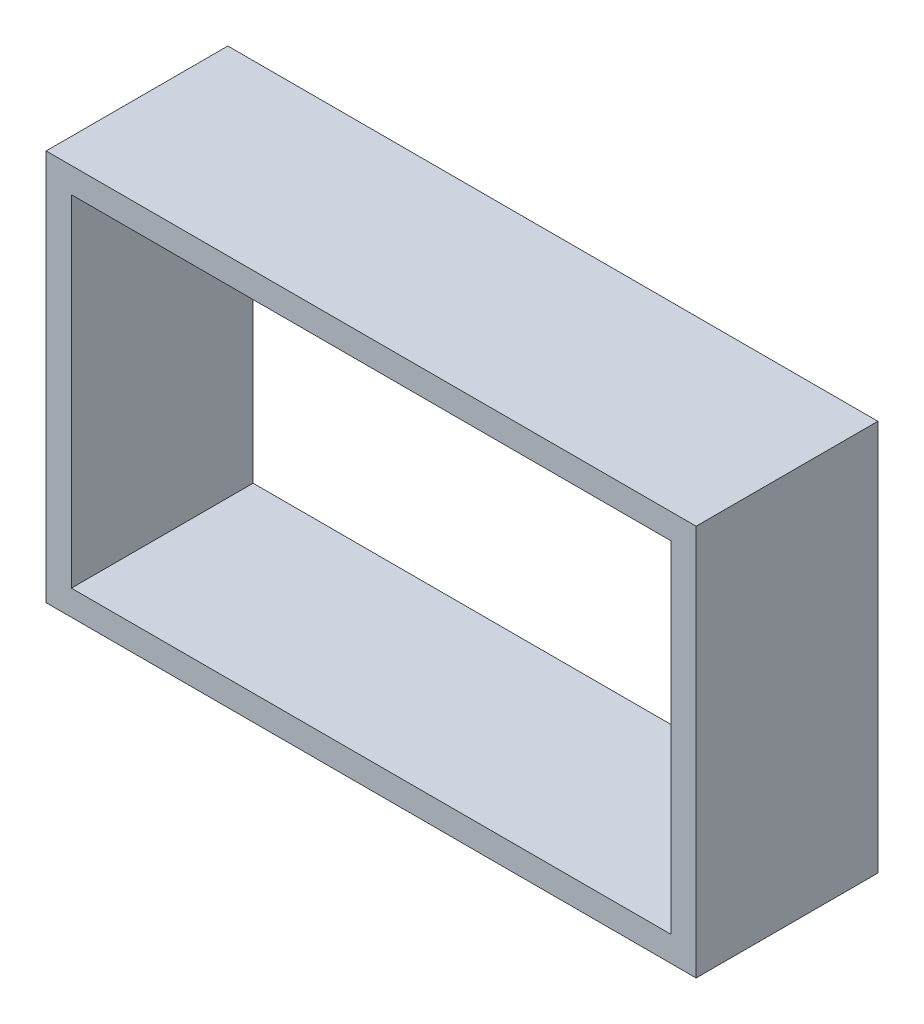
ISO-10303-21;
HEADER;
FILE_DESCRIPTION(('STEP AP214'),'2;1');
FILE_NAME('part.step','',(''),(''),'','','');
FILE_SCHEMA(('AUTOMOTIVE_DESIGN { 1 0 10303 214 1 1 1 1 }'));
ENDSEC;
DATA;
#1=APPLICATION_CONTEXT('core data for automotive mechanical design processes');
#2=APPLICATION_PROTOCOL_DEFINITION('international standard','automotive_design',2000,#1);
#3=PRODUCT_CONTEXT('',#1,'mechanical');
#4=PRODUCT('Part','Part','',(#3));
#5=PRODUCT_RELATED_PRODUCT_CATEGORY('part','',(#4));
#6=PRODUCT_DEFINITION_FORMATION('','',#4);
#7=PRODUCT_DEFINITION_CONTEXT('part definition',#1,'design');
#8=PRODUCT_DEFINITION('design','',#6,#7);
#9=PRODUCT_DEFINITION_SHAPE('','',#8);
#10=(LENGTH_UNIT() NAMED_UNIT(*) SI_UNIT(.MILLI.,.METRE.));
#11=(NAMED_UNIT(*) PLANE_ANGLE_UNIT() SI_UNIT($,.RADIAN.));
#12=(NAMED_UNIT(*) SI_UNIT($,.STERADIAN.) SOLID_ANGLE_UNIT());
#13=UNCERTAINTY_MEASURE_WITH_UNIT(LENGTH_MEASURE(1.E-05),#10,'distance_accuracy_value','');
#14=(GEOMETRIC_REPRESENTATION_CONTEXT(3) GLOBAL_UNCERTAINTY_ASSIGNED_CONTEXT((#13)) GLOBAL_UNIT_ASSIGNED_CONTEXT((#10,
#11,#12)) REPRESENTATION_CONTEXT('',''));
#15=CARTESIAN_POINT('',(0.,0.,0.));
#16=DIRECTION('',(0.,0.,1.));
#17=DIRECTION('',(1.,0.,0.));
#18=AXIS2_PLACEMENT_3D('',#15,#16,#17);
#19=CARTESIAN_POINT('',(0.,0.,14.4));
#20=DIRECTION('',(0.,0.,1.));
#21=DIRECTION('',(1.,0.,0.));
#22=AXIS2_PLACEMENT_3D('',#19,#20,#21);
#23=PLANE('',#22);
#24=DIRECTION('',(0.,-1.,0.));
#25=VECTOR('',#24,1.);
#26=CARTESIAN_POINT('',(-73.7343836950473,20.015625,14.4));
#27=LINE('',#26,#25);
#28=CARTESIAN_POINT('',(-73.7343836950473,20.015625,14.4));
#29=VERTEX_POINT('',#28);
#30=CARTESIAN_POINT('',(-73.7343836950473,-10.984375,14.4));
#31=VERTEX_POINT('',#30);
#32=EDGE_CURVE('E134',#29,#31,#27,.T.);
#33=ORIENTED_EDGE('',*,*,#32,.T.);
#34=DIRECTION('',(1.,0.,0.));
#35=VECTOR('',#34,1.);
#36=CARTESIAN_POINT('',(-73.7343836950473,-10.984375,14.4));
#37=LINE('',#36,#35);
#38=CARTESIAN_POINT('',(-22.2343836950473,-10.984375,14.4));
#39=VERTEX_POINT('',#38);
#40=EDGE_CURVE('E137',#31,#39,#37,.T.);
#41=ORIENTED_EDGE('',*,*,#40,.T.);
#42=DIRECTION('',(0.,1.,0.));
#43=VECTOR('',#42,1.);
#44=CARTESIAN_POINT('',(-22.2343836950473,20.015625,14.4));
#45=LINE('',#44,#43);
#46=CARTESIAN_POINT('',(-22.2343836950473,20.015625,14.4));
#47=VERTEX_POINT('',#46);
#48=EDGE_CURVE('E140',#39,#47,#45,.T.);
#49=ORIENTED_EDGE('',*,*,#48,.T.);
#50=DIRECTION('',(-1.,0.,0.));
#51=VECTOR('',#50,1.);
#52=CARTESIAN_POINT('',(-73.7343836950473,20.015625,14.4));
#53=LINE('',#52,#51);
#54=EDGE_CURVE('E142',#47,#29,#53,.T.);
#55=ORIENTED_EDGE('',*,*,#54,.T.);
#56=EDGE_LOOP('',(#33,#41,#49,#55));
#57=FACE_BOUND('',#56,.T.);
#58=DIRECTION('',(1.,0.,0.));
#59=VECTOR('',#58,1.);
#60=CARTESIAN_POINT('',(-71.7343836950473,-8.98437500000001,14.4));
#61=LINE('',#60,#59);
#62=CARTESIAN_POINT('',(-71.7343836950473,-8.98437500000001,14.4));
#63=VERTEX_POINT('',#62);
#64=CARTESIAN_POINT('',(-24.2343836950473,-8.98437500000001,14.4));
#65=VERTEX_POINT('',#64);
#66=EDGE_CURVE('E106',#63,#65,#61,.T.);
#67=ORIENTED_EDGE('',*,*,#66,.F.);
#68=DIRECTION('',(0.,-1.,0.));
#69=VECTOR('',#68,1.);
#70=CARTESIAN_POINT('',(-71.7343836950473,18.015625,14.4));
#71=LINE('',#70,#69);
#72=CARTESIAN_POINT('',(-71.7343836950473,18.015625,14.4));
#73=VERTEX_POINT('',#72);
#74=EDGE_CURVE('E98',#73,#63,#71,.T.);
#75=ORIENTED_EDGE('',*,*,#74,.F.);
#76=DIRECTION('',(-1.,0.,0.));
#77=VECTOR('',#76,1.);
#78=CARTESIAN_POINT('',(-71.7343836950473,18.015625,14.4));
#79=LINE('',#78,#77);
#80=CARTESIAN_POINT('',(-24.2343836950473,18.015625,14.4));
#81=VERTEX_POINT('',#80);
#82=EDGE_CURVE('E120',#81,#73,#79,.T.);
#83=ORIENTED_EDGE('',*,*,#82,.F.);
#84=DIRECTION('',(0.,1.,0.));
#85=VECTOR('',#84,1.);
#86=CARTESIAN_POINT('',(-24.2343836950473,18.015625,14.4));
#87=LINE('',#86,#85);
#88=EDGE_CURVE('E118',#65,#81,#87,.T.);
#89=ORIENTED_EDGE('',*,*,#88,.F.);
#90=EDGE_LOOP('',(#67,#75,#83,#89));
#91=FACE_BOUND('',#90,.T.);
#92=ADVANCED_FACE('F33',(#57,#91),#23,.T.);
#93=CARTESIAN_POINT('',(0.,0.,0.));
#94=DIRECTION('',(0.,0.,1.));
#95=DIRECTION('',(1.,0.,0.));
#96=AXIS2_PLACEMENT_3D('',#93,#94,#95);
#97=PLANE('',#96);
#98=DIRECTION('',(0.,-1.,0.));
#99=VECTOR('',#98,1.);
#100=CARTESIAN_POINT('',(-73.7343836950473,20.015625,0.));
#101=LINE('',#100,#99);
#102=CARTESIAN_POINT('',(-73.7343836950473,20.015625,0.));
#103=VERTEX_POINT('',#102);
#104=CARTESIAN_POINT('',(-73.7343836950473,-10.984375,0.));
#105=VERTEX_POINT('',#104);
#106=EDGE_CURVE('E114',#103,#105,#101,.T.);
#107=ORIENTED_EDGE('',*,*,#106,.F.);
#108=DIRECTION('',(-1.,0.,0.));
#109=VECTOR('',#108,1.);
#110=CARTESIAN_POINT('',(-73.7343836950473,20.015625,0.));
#111=LINE('',#110,#109);
#112=CARTESIAN_POINT('',(-22.2343836950473,20.015625,0.));
#113=VERTEX_POINT('',#112);
#114=EDGE_CURVE('E138',#113,#103,#111,.T.);
#115=ORIENTED_EDGE('',*,*,#114,.F.);
#116=DIRECTION('',(0.,1.,0.));
#117=VECTOR('',#116,1.);
#118=CARTESIAN_POINT('',(-22.2343836950473,20.015625,0.));
#119=LINE('',#118,#117);
#120=CARTESIAN_POINT('',(-22.2343836950473,-10.984375,0.));
#121=VERTEX_POINT('',#120);
#122=EDGE_CURVE('E149',#121,#113,#119,.T.);
#123=ORIENTED_EDGE('',*,*,#122,.F.);
#124=DIRECTION('',(1.,0.,0.));
#125=VECTOR('',#124,1.);
#126=CARTESIAN_POINT('',(-73.7343836950473,-10.984375,0.));
#127=LINE('',#126,#125);
#128=EDGE_CURVE('E147',#105,#121,#127,.T.);
#129=ORIENTED_EDGE('',*,*,#128,.F.);
#130=EDGE_LOOP('',(#107,#115,#123,#129));
#131=FACE_BOUND('',#130,.T.);
#132=DIRECTION('',(0.,-1.,0.));
#133=VECTOR('',#132,1.);
#134=CARTESIAN_POINT('',(-71.7343836950473,18.015625,0.));
#135=LINE('',#134,#133);
#136=CARTESIAN_POINT('',(-71.7343836950473,18.015625,0.));
#137=VERTEX_POINT('',#136);
#138=CARTESIAN_POINT('',(-71.7343836950473,-8.98437500000001,0.));
#139=VERTEX_POINT('',#138);
#140=EDGE_CURVE('E56',#137,#139,#135,.T.);
#141=ORIENTED_EDGE('',*,*,#140,.T.);
#142=DIRECTION('',(1.,0.,0.));
#143=VECTOR('',#142,1.);
#144=CARTESIAN_POINT('',(-71.7343836950473,-8.98437500000001,0.));
#145=LINE('',#144,#143);
#146=CARTESIAN_POINT('',(-24.2343836950473,-8.98437500000001,0.));
#147=VERTEX_POINT('',#146);
#148=EDGE_CURVE('E113',#139,#147,#145,.T.);
#149=ORIENTED_EDGE('',*,*,#148,.T.);
#150=DIRECTION('',(0.,1.,0.));
#151=VECTOR('',#150,1.);
#152=CARTESIAN_POINT('',(-24.2343836950473,18.015625,0.));
#153=LINE('',#152,#151);
#154=CARTESIAN_POINT('',(-24.2343836950473,18.015625,0.));
#155=VERTEX_POINT('',#154);
#156=EDGE_CURVE('E126',#147,#155,#153,.T.);
#157=ORIENTED_EDGE('',*,*,#156,.T.);
#158=DIRECTION('',(-1.,0.,0.));
#159=VECTOR('',#158,1.);
#160=CARTESIAN_POINT('',(-71.7343836950473,18.015625,0.));
#161=LINE('',#160,#159);
#162=EDGE_CURVE('E107',#155,#137,#161,.T.);
#163=ORIENTED_EDGE('',*,*,#162,.T.);
#164=EDGE_LOOP('',(#141,#149,#157,#163));
#165=FACE_BOUND('',#164,.T.);
#166=ADVANCED_FACE('F167',(#131,#165),#97,.F.);
#167=CARTESIAN_POINT('',(-73.7343836950473,20.015625,14.4));
#168=DIRECTION('',(1.,0.,0.));
#169=DIRECTION('',(0.,0.,-1.));
#170=AXIS2_PLACEMENT_3D('',#167,#168,#169);
#171=PLANE('',#170);
#172=ORIENTED_EDGE('',*,*,#106,.T.);
#173=DIRECTION('',(0.,0.,-1.));
#174=VECTOR('',#173,1.);
#175=CARTESIAN_POINT('',(-73.7343836950473,-10.984375,14.4));
#176=LINE('',#175,#174);
#177=EDGE_CURVE('E11',#31,#105,#176,.T.);
#178=ORIENTED_EDGE('',*,*,#177,.F.);
#179=ORIENTED_EDGE('',*,*,#32,.F.);
#180=DIRECTION('',(0.,0.,-1.));
#181=VECTOR('',#180,1.);
#182=CARTESIAN_POINT('',(-73.7343836950473,20.015625,14.4));
#183=LINE('',#182,#181);
#184=EDGE_CURVE('E144',#29,#103,#183,.T.);
#185=ORIENTED_EDGE('',*,*,#184,.T.);
#186=EDGE_LOOP('',(#172,#178,#179,#185));
#187=FACE_BOUND('',#186,.T.);
#188=ADVANCED_FACE('F35',(#187),#171,.F.);
#189=CARTESIAN_POINT('',(-73.7343836950473,-10.984375,14.4));
#190=DIRECTION('',(0.,1.,0.));
#191=DIRECTION('',(0.,0.,1.));
#192=AXIS2_PLACEMENT_3D('',#189,#190,#191);
#193=PLANE('',#192);
#194=ORIENTED_EDGE('',*,*,#128,.T.);
#195=DIRECTION('',(0.,0.,-1.));
#196=VECTOR('',#195,1.);
#197=CARTESIAN_POINT('',(-22.2343836950473,-10.984375,14.4));
#198=LINE('',#197,#196);
#199=EDGE_CURVE('E41',#39,#121,#198,.T.);
#200=ORIENTED_EDGE('',*,*,#199,.F.);
#201=ORIENTED_EDGE('',*,*,#40,.F.);
#202=ORIENTED_EDGE('',*,*,#177,.T.);
#203=EDGE_LOOP('',(#194,#200,#201,#202));
#204=FACE_BOUND('',#203,.T.);
#205=ADVANCED_FACE('F177',(#204),#193,.F.);
#206=CARTESIAN_POINT('',(-22.2343836950473,20.015625,14.4));
#207=DIRECTION('',(-1.,0.,0.));
#208=DIRECTION('',(0.,-1.,0.));
#209=AXIS2_PLACEMENT_3D('',#206,#207,#208);
#210=PLANE('',#209);
#211=ORIENTED_EDGE('',*,*,#122,.T.);
#212=DIRECTION('',(0.,0.,-1.));
#213=VECTOR('',#212,1.);
#214=CARTESIAN_POINT('',(-22.2343836950473,20.015625,14.4));
#215=LINE('',#214,#213);
#216=EDGE_CURVE('E154',#47,#113,#215,.T.);
#217=ORIENTED_EDGE('',*,*,#216,.F.);
#218=ORIENTED_EDGE('',*,*,#48,.F.);
#219=ORIENTED_EDGE('',*,*,#199,.T.);
#220=EDGE_LOOP('',(#211,#217,#218,#219));
#221=FACE_BOUND('',#220,.T.);
#222=ADVANCED_FACE('F161',(#221),#210,.F.);
#223=CARTESIAN_POINT('',(-73.7343836950473,20.015625,14.4));
#224=DIRECTION('',(0.,-1.,0.));
#225=DIRECTION('',(0.,0.,-1.));
#226=AXIS2_PLACEMENT_3D('',#223,#224,#225);
#227=PLANE('',#226);
#228=ORIENTED_EDGE('',*,*,#114,.T.);
#229=ORIENTED_EDGE('',*,*,#184,.F.);
#230=ORIENTED_EDGE('',*,*,#54,.F.);
#231=ORIENTED_EDGE('',*,*,#216,.T.);
#232=EDGE_LOOP('',(#228,#229,#230,#231));
#233=FACE_BOUND('',#232,.T.);
#234=ADVANCED_FACE('F171',(#233),#227,.F.);
#235=CARTESIAN_POINT('',(-71.7343836950473,18.015625,14.4));
#236=DIRECTION('',(1.,0.,0.));
#237=DIRECTION('',(0.,0.,-1.));
#238=AXIS2_PLACEMENT_3D('',#235,#236,#237);
#239=PLANE('',#238);
#240=ORIENTED_EDGE('',*,*,#140,.F.);
#241=DIRECTION('',(0.,0.,-1.));
#242=VECTOR('',#241,1.);
#243=CARTESIAN_POINT('',(-71.7343836950473,18.015625,14.4));
#244=LINE('',#243,#242);
#245=EDGE_CURVE('E102',#73,#137,#244,.T.);
#246=ORIENTED_EDGE('',*,*,#245,.F.);
#247=ORIENTED_EDGE('',*,*,#74,.T.);
#248=DIRECTION('',(0.,0.,-1.));
#249=VECTOR('',#248,1.);
#250=CARTESIAN_POINT('',(-71.7343836950473,-8.98437500000001,14.4));
#251=LINE('',#250,#249);
#252=EDGE_CURVE('E101',#63,#139,#251,.T.);
#253=ORIENTED_EDGE('',*,*,#252,.T.);
#254=EDGE_LOOP('',(#240,#246,#247,#253));
#255=FACE_BOUND('',#254,.T.);
#256=ADVANCED_FACE('F100',(#255),#239,.T.);
#257=CARTESIAN_POINT('',(-71.7343836950473,-8.98437500000001,14.4));
#258=DIRECTION('',(0.,1.,0.));
#259=DIRECTION('',(0.,0.,1.));
#260=AXIS2_PLACEMENT_3D('',#257,#258,#259);
#261=PLANE('',#260);
#262=ORIENTED_EDGE('',*,*,#148,.F.);
#263=ORIENTED_EDGE('',*,*,#252,.F.);
#264=ORIENTED_EDGE('',*,*,#66,.T.);
#265=DIRECTION('',(0.,0.,-1.));
#266=VECTOR('',#265,1.);
#267=CARTESIAN_POINT('',(-24.2343836950473,-8.98437500000001,14.4));
#268=LINE('',#267,#266);
#269=EDGE_CURVE('E115',#65,#147,#268,.T.);
#270=ORIENTED_EDGE('',*,*,#269,.T.);
#271=EDGE_LOOP('',(#262,#263,#264,#270));
#272=FACE_BOUND('',#271,.T.);
#273=ADVANCED_FACE('F110',(#272),#261,.T.);
#274=CARTESIAN_POINT('',(-24.2343836950473,18.015625,14.4));
#275=DIRECTION('',(-1.,0.,0.));
#276=DIRECTION('',(0.,0.,1.));
#277=AXIS2_PLACEMENT_3D('',#274,#275,#276);
#278=PLANE('',#277);
#279=ORIENTED_EDGE('',*,*,#156,.F.);
#280=ORIENTED_EDGE('',*,*,#269,.F.);
#281=ORIENTED_EDGE('',*,*,#88,.T.);
#282=DIRECTION('',(0.,0.,-1.));
#283=VECTOR('',#282,1.);
#284=CARTESIAN_POINT('',(-24.2343836950473,18.015625,14.4));
#285=LINE('',#284,#283);
#286=EDGE_CURVE('E48',#81,#155,#285,.T.);
#287=ORIENTED_EDGE('',*,*,#286,.T.);
#288=EDGE_LOOP('',(#279,#280,#281,#287));
#289=FACE_BOUND('',#288,.T.);
#290=ADVANCED_FACE('F200',(#289),#278,.T.);
#291=CARTESIAN_POINT('',(-71.7343836950473,18.015625,14.4));
#292=DIRECTION('',(0.,-1.,0.));
#293=DIRECTION('',(0.,0.,-1.));
#294=AXIS2_PLACEMENT_3D('',#291,#292,#293);
#295=PLANE('',#294);
#296=ORIENTED_EDGE('',*,*,#162,.F.);
#297=ORIENTED_EDGE('',*,*,#286,.F.);
#298=ORIENTED_EDGE('',*,*,#82,.T.);
#299=ORIENTED_EDGE('',*,*,#245,.T.);
#300=EDGE_LOOP('',(#296,#297,#298,#299));
#301=FACE_BOUND('',#300,.T.);
#302=ADVANCED_FACE('F204',(#301),#295,.T.);
#303=CLOSED_SHELL('',(#92,#166,#188,#205,#222,#234,#256,#273,#290,#302));
#304=MANIFOLD_SOLID_BREP('B2',#303);
#305=ADVANCED_BREP_SHAPE_REPRESENTATION('',(#18,#304),#14);
#306=SHAPE_DEFINITION_REPRESENTATION(#9,#305);
ENDSEC;
END-ISO-10303-21;
